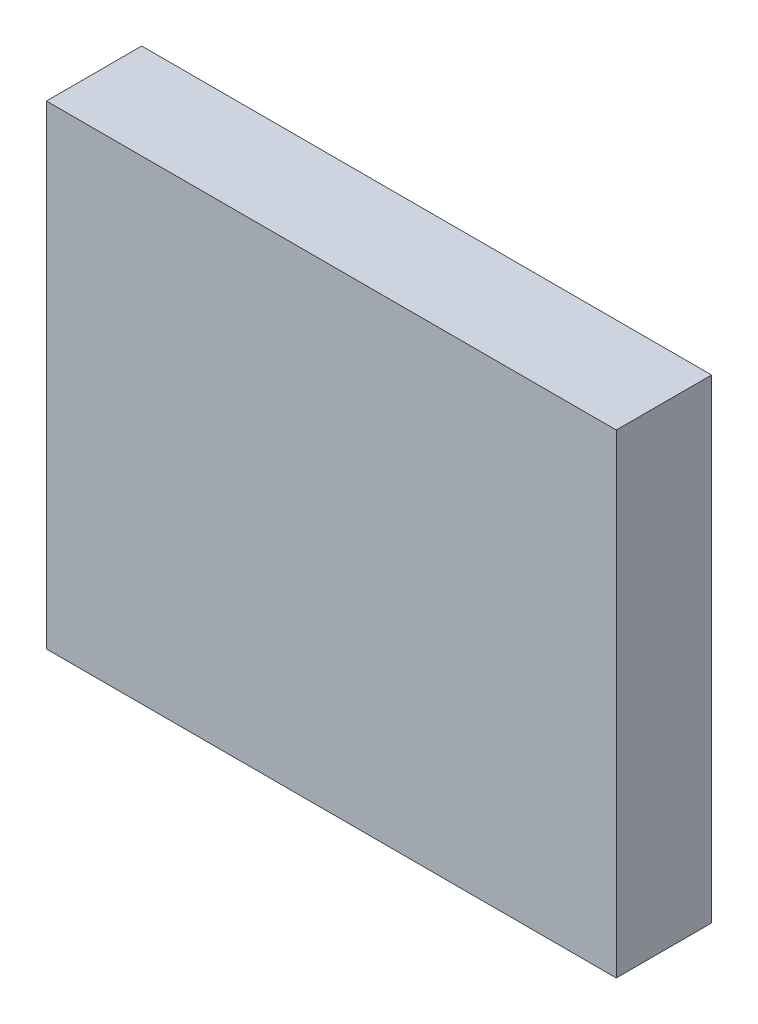
ISO-10303-21;
HEADER;
FILE_DESCRIPTION(('STEP AP214'),'2;1');
FILE_NAME('part.step','',(''),(''),'','','');
FILE_SCHEMA(('AUTOMOTIVE_DESIGN { 1 0 10303 214 1 1 1 1 }'));
ENDSEC;
DATA;
#1=APPLICATION_CONTEXT('core data for automotive mechanical design processes');
#2=APPLICATION_PROTOCOL_DEFINITION('international standard','automotive_design',2000,#1);
#3=PRODUCT_CONTEXT('',#1,'mechanical');
#4=PRODUCT('Part','Part','',(#3));
#5=PRODUCT_RELATED_PRODUCT_CATEGORY('part','',(#4));
#6=PRODUCT_DEFINITION_FORMATION('','',#4);
#7=PRODUCT_DEFINITION_CONTEXT('part definition',#1,'design');
#8=PRODUCT_DEFINITION('design','',#6,#7);
#9=PRODUCT_DEFINITION_SHAPE('','',#8);
#10=(LENGTH_UNIT() NAMED_UNIT(*) SI_UNIT(.MILLI.,.METRE.));
#11=(NAMED_UNIT(*) PLANE_ANGLE_UNIT() SI_UNIT($,.RADIAN.));
#12=(NAMED_UNIT(*) SI_UNIT($,.STERADIAN.) SOLID_ANGLE_UNIT());
#13=UNCERTAINTY_MEASURE_WITH_UNIT(LENGTH_MEASURE(1.E-05),#10,'distance_accuracy_value','');
#14=(GEOMETRIC_REPRESENTATION_CONTEXT(3) GLOBAL_UNCERTAINTY_ASSIGNED_CONTEXT((#13)) GLOBAL_UNIT_ASSIGNED_CONTEXT((#10,
#11,#12)) REPRESENTATION_CONTEXT('',''));
#15=CARTESIAN_POINT('',(0.,0.,0.));
#16=DIRECTION('',(0.,0.,1.));
#17=DIRECTION('',(1.,0.,0.));
#18=AXIS2_PLACEMENT_3D('',#15,#16,#17);
#19=CARTESIAN_POINT('',(-1.003,0.373,0.));
#20=DIRECTION('',(0.,-1.,0.));
#21=DIRECTION('',(0.,0.,1.));
#22=AXIS2_PLACEMENT_3D('',#19,#20,#21);
#23=PLANE('',#22);
#24=DIRECTION('',(-1.,0.,0.));
#25=VECTOR('',#24,1.);
#26=CARTESIAN_POINT('',(-0.698,0.373,0.));
#27=LINE('',#26,#25);
#28=CARTESIAN_POINT('',(-0.698,0.373,0.));
#29=VERTEX_POINT('',#28);
#30=CARTESIAN_POINT('',(-1.003,0.373,0.));
#31=VERTEX_POINT('',#30);
#32=EDGE_CURVE('E11',#29,#31,#27,.T.);
#33=ORIENTED_EDGE('',*,*,#32,.F.);
#34=DIRECTION('',(0.,0.,-1.));
#35=VECTOR('',#34,1.);
#36=CARTESIAN_POINT('',(-0.698,0.373,0.051));
#37=LINE('',#36,#35);
#38=CARTESIAN_POINT('',(-0.698,0.373,0.051));
#39=VERTEX_POINT('',#38);
#40=EDGE_CURVE('E24',#39,#29,#37,.T.);
#41=ORIENTED_EDGE('',*,*,#40,.F.);
#42=DIRECTION('',(1.,0.,0.));
#43=VECTOR('',#42,1.);
#44=CARTESIAN_POINT('',(-1.003,0.373,0.051));
#45=LINE('',#44,#43);
#46=CARTESIAN_POINT('',(-1.003,0.373,0.051));
#47=VERTEX_POINT('',#46);
#48=EDGE_CURVE('E88',#47,#39,#45,.T.);
#49=ORIENTED_EDGE('',*,*,#48,.F.);
#50=DIRECTION('',(0.,0.,1.));
#51=VECTOR('',#50,1.);
#52=CARTESIAN_POINT('',(-1.003,0.373,0.));
#53=LINE('',#52,#51);
#54=EDGE_CURVE('E77',#31,#47,#53,.T.);
#55=ORIENTED_EDGE('',*,*,#54,.F.);
#56=EDGE_LOOP('',(#33,#41,#49,#55));
#57=FACE_BOUND('',#56,.T.);
#58=ADVANCED_FACE('F17',(#57),#23,.T.);
#59=CARTESIAN_POINT('',(-0.698,0.373,0.));
#60=DIRECTION('',(1.,0.,0.));
#61=DIRECTION('',(0.,0.,1.));
#62=AXIS2_PLACEMENT_3D('',#59,#60,#61);
#63=PLANE('',#62);
#64=DIRECTION('',(0.,-1.,0.));
#65=VECTOR('',#64,1.);
#66=CARTESIAN_POINT('',(-0.698,0.627,0.));
#67=LINE('',#66,#65);
#68=CARTESIAN_POINT('',(-0.698,0.627,0.));
#69=VERTEX_POINT('',#68);
#70=EDGE_CURVE('E85',#69,#29,#67,.T.);
#71=ORIENTED_EDGE('',*,*,#70,.F.);
#72=DIRECTION('',(0.,0.,-1.));
#73=VECTOR('',#72,1.);
#74=CARTESIAN_POINT('',(-0.698,0.627,0.051));
#75=LINE('',#74,#73);
#76=CARTESIAN_POINT('',(-0.698,0.627,0.051));
#77=VERTEX_POINT('',#76);
#78=EDGE_CURVE('E83',#77,#69,#75,.T.);
#79=ORIENTED_EDGE('',*,*,#78,.F.);
#80=DIRECTION('',(0.,1.,0.));
#81=VECTOR('',#80,1.);
#82=CARTESIAN_POINT('',(-0.698,0.373,0.051));
#83=LINE('',#82,#81);
#84=EDGE_CURVE('E72',#39,#77,#83,.T.);
#85=ORIENTED_EDGE('',*,*,#84,.F.);
#86=ORIENTED_EDGE('',*,*,#40,.T.);
#87=EDGE_LOOP('',(#71,#79,#85,#86));
#88=FACE_BOUND('',#87,.T.);
#89=ADVANCED_FACE('F90',(#88),#63,.T.);
#90=CARTESIAN_POINT('',(-0.698,0.627,0.));
#91=DIRECTION('',(0.,1.,0.));
#92=DIRECTION('',(0.,0.,1.));
#93=AXIS2_PLACEMENT_3D('',#90,#91,#92);
#94=PLANE('',#93);
#95=DIRECTION('',(1.,0.,0.));
#96=VECTOR('',#95,1.);
#97=CARTESIAN_POINT('',(-1.003,0.627,0.));
#98=LINE('',#97,#96);
#99=CARTESIAN_POINT('',(-1.003,0.627,0.));
#100=VERTEX_POINT('',#99);
#101=EDGE_CURVE('E60',#100,#69,#98,.T.);
#102=ORIENTED_EDGE('',*,*,#101,.F.);
#103=DIRECTION('',(0.,0.,-1.));
#104=VECTOR('',#103,1.);
#105=CARTESIAN_POINT('',(-1.003,0.627,0.051));
#106=LINE('',#105,#104);
#107=CARTESIAN_POINT('',(-1.003,0.627,0.051));
#108=VERTEX_POINT('',#107);
#109=EDGE_CURVE('E54',#108,#100,#106,.T.);
#110=ORIENTED_EDGE('',*,*,#109,.F.);
#111=DIRECTION('',(-1.,0.,0.));
#112=VECTOR('',#111,1.);
#113=CARTESIAN_POINT('',(-0.698,0.627,0.051));
#114=LINE('',#113,#112);
#115=EDGE_CURVE('E58',#77,#108,#114,.T.);
#116=ORIENTED_EDGE('',*,*,#115,.F.);
#117=ORIENTED_EDGE('',*,*,#78,.T.);
#118=EDGE_LOOP('',(#102,#110,#116,#117));
#119=FACE_BOUND('',#118,.T.);
#120=ADVANCED_FACE('F56',(#119),#94,.T.);
#121=CARTESIAN_POINT('',(-1.003,0.627,0.));
#122=DIRECTION('',(-1.,0.,0.));
#123=DIRECTION('',(0.,0.,1.));
#124=AXIS2_PLACEMENT_3D('',#121,#122,#123);
#125=PLANE('',#124);
#126=DIRECTION('',(0.,1.,0.));
#127=VECTOR('',#126,1.);
#128=CARTESIAN_POINT('',(-1.003,0.373,0.));
#129=LINE('',#128,#127);
#130=EDGE_CURVE('E73',#31,#100,#129,.T.);
#131=ORIENTED_EDGE('',*,*,#130,.F.);
#132=ORIENTED_EDGE('',*,*,#54,.T.);
#133=DIRECTION('',(0.,-1.,0.));
#134=VECTOR('',#133,1.);
#135=CARTESIAN_POINT('',(-1.003,0.627,0.051));
#136=LINE('',#135,#134);
#137=EDGE_CURVE('E70',#108,#47,#136,.T.);
#138=ORIENTED_EDGE('',*,*,#137,.F.);
#139=ORIENTED_EDGE('',*,*,#109,.T.);
#140=EDGE_LOOP('',(#131,#132,#138,#139));
#141=FACE_BOUND('',#140,.T.);
#142=ADVANCED_FACE('F76',(#141),#125,.T.);
#143=CARTESIAN_POINT('',(-1.003,0.627,0.));
#144=DIRECTION('',(0.,0.,-1.));
#145=DIRECTION('',(0.,1.,0.));
#146=AXIS2_PLACEMENT_3D('',#143,#144,#145);
#147=PLANE('',#146);
#148=ORIENTED_EDGE('',*,*,#101,.T.);
#149=ORIENTED_EDGE('',*,*,#70,.T.);
#150=ORIENTED_EDGE('',*,*,#32,.T.);
#151=ORIENTED_EDGE('',*,*,#130,.T.);
#152=EDGE_LOOP('',(#148,#149,#150,#151));
#153=FACE_BOUND('',#152,.T.);
#154=ADVANCED_FACE('F91',(#153),#147,.T.);
#155=CARTESIAN_POINT('',(-1.003,0.373,0.051));
#156=DIRECTION('',(0.,0.,1.));
#157=DIRECTION('',(0.,1.,0.));
#158=AXIS2_PLACEMENT_3D('',#155,#156,#157);
#159=PLANE('',#158);
#160=ORIENTED_EDGE('',*,*,#48,.T.);
#161=ORIENTED_EDGE('',*,*,#84,.T.);
#162=ORIENTED_EDGE('',*,*,#115,.T.);
#163=ORIENTED_EDGE('',*,*,#137,.T.);
#164=EDGE_LOOP('',(#160,#161,#162,#163));
#165=FACE_BOUND('',#164,.T.);
#166=ADVANCED_FACE('F69',(#165),#159,.T.);
#167=CLOSED_SHELL('',(#58,#89,#120,#142,#154,#166));
#168=MANIFOLD_SOLID_BREP('B1',#167);
#169=ADVANCED_BREP_SHAPE_REPRESENTATION('',(#18,#168),#14);
#170=SHAPE_DEFINITION_REPRESENTATION(#9,#169);
ENDSEC;
END-ISO-10303-21;
